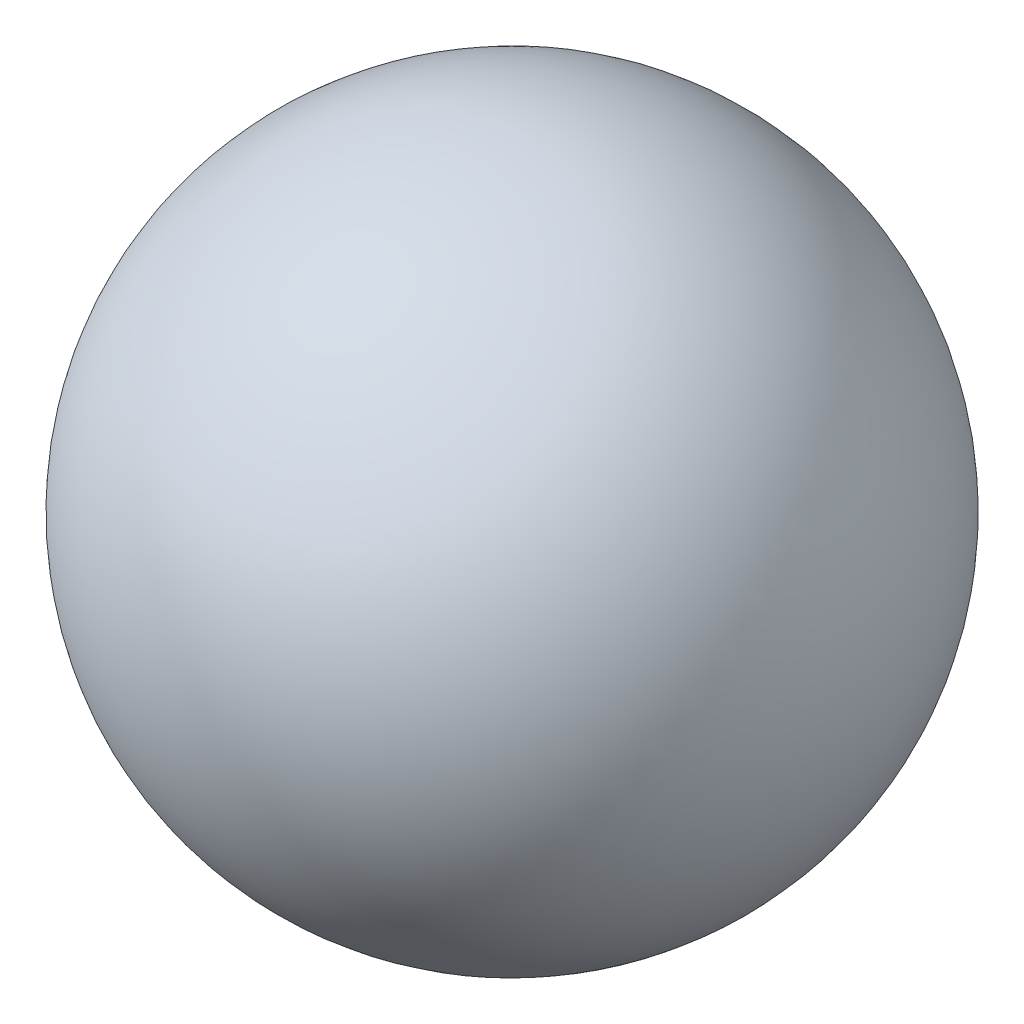
ISO-10303-21;
HEADER;
FILE_DESCRIPTION(('STEP AP214'),'2;1');
FILE_NAME('part.step','',(''),(''),'','','');
FILE_SCHEMA(('AUTOMOTIVE_DESIGN { 1 0 10303 214 1 1 1 1 }'));
ENDSEC;
DATA;
#1=APPLICATION_CONTEXT('core data for automotive mechanical design processes');
#2=APPLICATION_PROTOCOL_DEFINITION('international standard','automotive_design',2000,#1);
#3=PRODUCT_CONTEXT('',#1,'mechanical');
#4=PRODUCT('Part','Part','',(#3));
#5=PRODUCT_RELATED_PRODUCT_CATEGORY('part','',(#4));
#6=PRODUCT_DEFINITION_FORMATION('','',#4);
#7=PRODUCT_DEFINITION_CONTEXT('part definition',#1,'design');
#8=PRODUCT_DEFINITION('design','',#6,#7);
#9=PRODUCT_DEFINITION_SHAPE('','',#8);
#10=(LENGTH_UNIT() NAMED_UNIT(*) SI_UNIT(.MILLI.,.METRE.));
#11=(NAMED_UNIT(*) PLANE_ANGLE_UNIT() SI_UNIT($,.RADIAN.));
#12=(NAMED_UNIT(*) SI_UNIT($,.STERADIAN.) SOLID_ANGLE_UNIT());
#13=UNCERTAINTY_MEASURE_WITH_UNIT(LENGTH_MEASURE(1.E-05),#10,'distance_accuracy_value','');
#14=(GEOMETRIC_REPRESENTATION_CONTEXT(3) GLOBAL_UNCERTAINTY_ASSIGNED_CONTEXT((#13)) GLOBAL_UNIT_ASSIGNED_CONTEXT((#10,
#11,#12)) REPRESENTATION_CONTEXT('',''));
#15=CARTESIAN_POINT('',(0.,0.,0.));
#16=DIRECTION('',(0.,0.,1.));
#17=DIRECTION('',(1.,0.,0.));
#18=AXIS2_PLACEMENT_3D('',#15,#16,#17);
#19=CARTESIAN_POINT('',(64.16,-67.8060174553842,-14.7086602326704));
#20=DIRECTION('',(0.,-0.977271341040091,-0.211992278118135));
#21=DIRECTION('',(0.173648177666935,0.208771639069458,-0.962424393452912));
#22=AXIS2_PLACEMENT_3D('',#19,#20,#21);
#23=SPHERICAL_SURFACE('',#22,7.15);
#24=CARTESIAN_POINT('',(64.16,-60.8185273669476,-13.1929154441258));
#25=VERTEX_POINT('',#24);
#26=VERTEX_LOOP('',#25);
#27=FACE_BOUND('',#26,.T.);
#28=CARTESIAN_POINT('',(64.16,-74.7935075438209,-16.2244050212151));
#29=VERTEX_POINT('',#28);
#30=VERTEX_LOOP('',#29);
#31=FACE_BOUND('',#30,.T.);
#32=ADVANCED_FACE('F15',(#27,#31),#23,.T.);
#33=CLOSED_SHELL('',(#32));
#34=MANIFOLD_SOLID_BREP('B1',#33);
#35=ADVANCED_BREP_SHAPE_REPRESENTATION('',(#18,#34),#14);
#36=SHAPE_DEFINITION_REPRESENTATION(#9,#35);
ENDSEC;
END-ISO-10303-21;
